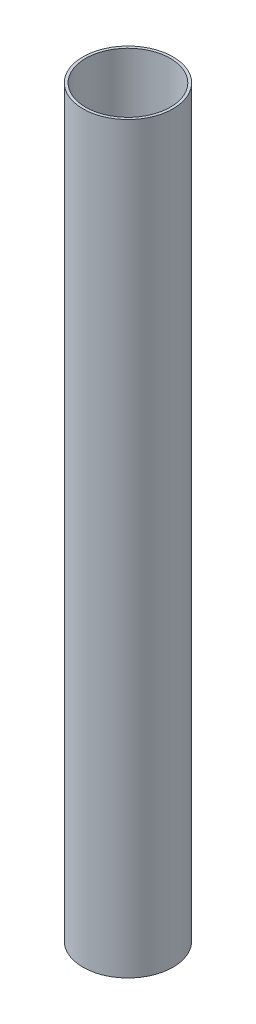
ISO-10303-21;
HEADER;
FILE_DESCRIPTION(('STEP AP214'),'2;1');
FILE_NAME('part.step','',(''),(''),'','','');
FILE_SCHEMA(('AUTOMOTIVE_DESIGN { 1 0 10303 214 1 1 1 1 }'));
ENDSEC;
DATA;
#1=APPLICATION_CONTEXT('core data for automotive mechanical design processes');
#2=APPLICATION_PROTOCOL_DEFINITION('international standard','automotive_design',2000,#1);
#3=PRODUCT_CONTEXT('',#1,'mechanical');
#4=PRODUCT('Part','Part','',(#3));
#5=PRODUCT_RELATED_PRODUCT_CATEGORY('part','',(#4));
#6=PRODUCT_DEFINITION_FORMATION('','',#4);
#7=PRODUCT_DEFINITION_CONTEXT('part definition',#1,'design');
#8=PRODUCT_DEFINITION('design','',#6,#7);
#9=PRODUCT_DEFINITION_SHAPE('','',#8);
#10=(LENGTH_UNIT() NAMED_UNIT(*) SI_UNIT(.MILLI.,.METRE.));
#11=(NAMED_UNIT(*) PLANE_ANGLE_UNIT() SI_UNIT($,.RADIAN.));
#12=(NAMED_UNIT(*) SI_UNIT($,.STERADIAN.) SOLID_ANGLE_UNIT());
#13=UNCERTAINTY_MEASURE_WITH_UNIT(LENGTH_MEASURE(1.E-05),#10,'distance_accuracy_value','');
#14=(GEOMETRIC_REPRESENTATION_CONTEXT(3) GLOBAL_UNCERTAINTY_ASSIGNED_CONTEXT((#13)) GLOBAL_UNIT_ASSIGNED_CONTEXT((#10,
#11,#12)) REPRESENTATION_CONTEXT('',''));
#15=CARTESIAN_POINT('',(0.,0.,0.));
#16=DIRECTION('',(0.,0.,1.));
#17=DIRECTION('',(1.,0.,0.));
#18=AXIS2_PLACEMENT_3D('',#15,#16,#17);
#19=CARTESIAN_POINT('',(0.,825.,0.));
#20=DIRECTION('',(0.,1.,0.));
#21=DIRECTION('',(0.,0.,1.));
#22=AXIS2_PLACEMENT_3D('',#19,#20,#21);
#23=PLANE('',#22);
#24=CARTESIAN_POINT('',(0.,825.,0.));
#25=DIRECTION('',(0.,1.,0.));
#26=DIRECTION('',(0.,0.,1.));
#27=AXIS2_PLACEMENT_3D('',#24,#25,#26);
#28=CIRCLE('',#27,50.);
#29=CARTESIAN_POINT('',(0.,825.,50.));
#30=VERTEX_POINT('',#29);
#31=EDGE_CURVE('E10',#30,#30,#28,.T.);
#32=ORIENTED_EDGE('',*,*,#31,.T.);
#33=EDGE_LOOP('',(#32));
#34=FACE_BOUND('',#33,.T.);
#35=CARTESIAN_POINT('',(0.,825.,0.));
#36=DIRECTION('',(0.,1.,0.));
#37=DIRECTION('',(0.,0.,1.));
#38=AXIS2_PLACEMENT_3D('',#35,#36,#37);
#39=CIRCLE('',#38,47.);
#40=CARTESIAN_POINT('',(0.,825.,47.));
#41=VERTEX_POINT('',#40);
#42=EDGE_CURVE('E48',#41,#41,#39,.T.);
#43=ORIENTED_EDGE('',*,*,#42,.F.);
#44=EDGE_LOOP('',(#43));
#45=FACE_BOUND('',#44,.T.);
#46=ADVANCED_FACE('F37',(#34,#45),#23,.T.);
#47=CARTESIAN_POINT('',(0.,0.,0.));
#48=DIRECTION('',(0.,1.,0.));
#49=DIRECTION('',(0.,0.,1.));
#50=AXIS2_PLACEMENT_3D('',#47,#48,#49);
#51=PLANE('',#50);
#52=CARTESIAN_POINT('',(0.,0.,0.));
#53=DIRECTION('',(0.,1.,0.));
#54=DIRECTION('',(0.,0.,1.));
#55=AXIS2_PLACEMENT_3D('',#52,#53,#54);
#56=CIRCLE('',#55,50.);
#57=CARTESIAN_POINT('',(0.,0.,50.));
#58=VERTEX_POINT('',#57);
#59=EDGE_CURVE('E41',#58,#58,#56,.T.);
#60=ORIENTED_EDGE('',*,*,#59,.F.);
#61=EDGE_LOOP('',(#60));
#62=FACE_BOUND('',#61,.T.);
#63=CARTESIAN_POINT('',(0.,0.,0.));
#64=DIRECTION('',(0.,1.,0.));
#65=DIRECTION('',(0.,0.,1.));
#66=AXIS2_PLACEMENT_3D('',#63,#64,#65);
#67=CIRCLE('',#66,47.);
#68=CARTESIAN_POINT('',(0.,0.,47.));
#69=VERTEX_POINT('',#68);
#70=EDGE_CURVE('E50',#69,#69,#67,.T.);
#71=ORIENTED_EDGE('',*,*,#70,.T.);
#72=EDGE_LOOP('',(#71));
#73=FACE_BOUND('',#72,.T.);
#74=ADVANCED_FACE('F60',(#62,#73),#51,.F.);
#75=CARTESIAN_POINT('',(0.,825.,0.));
#76=DIRECTION('',(0.,-1.,0.));
#77=DIRECTION('',(0.,0.,-1.));
#78=AXIS2_PLACEMENT_3D('',#75,#76,#77);
#79=CYLINDRICAL_SURFACE('',#78,50.);
#80=ORIENTED_EDGE('',*,*,#31,.F.);
#81=EDGE_LOOP('',(#80));
#82=FACE_BOUND('',#81,.T.);
#83=ORIENTED_EDGE('',*,*,#59,.T.);
#84=EDGE_LOOP('',(#83));
#85=FACE_BOUND('',#84,.T.);
#86=ADVANCED_FACE('F39',(#82,#85),#79,.T.);
#87=CARTESIAN_POINT('',(0.,825.,0.));
#88=DIRECTION('',(0.,-1.,0.));
#89=DIRECTION('',(0.,0.,-1.));
#90=AXIS2_PLACEMENT_3D('',#87,#88,#89);
#91=CYLINDRICAL_SURFACE('',#90,47.);
#92=ORIENTED_EDGE('',*,*,#42,.T.);
#93=EDGE_LOOP('',(#92));
#94=FACE_BOUND('',#93,.T.);
#95=ORIENTED_EDGE('',*,*,#70,.F.);
#96=EDGE_LOOP('',(#95));
#97=FACE_BOUND('',#96,.T.);
#98=ADVANCED_FACE('F56',(#94,#97),#91,.F.);
#99=CLOSED_SHELL('',(#46,#74,#86,#98));
#100=MANIFOLD_SOLID_BREP('B2',#99);
#101=ADVANCED_BREP_SHAPE_REPRESENTATION('',(#18,#100),#14);
#102=SHAPE_DEFINITION_REPRESENTATION(#9,#101);
ENDSEC;
END-ISO-10303-21;
